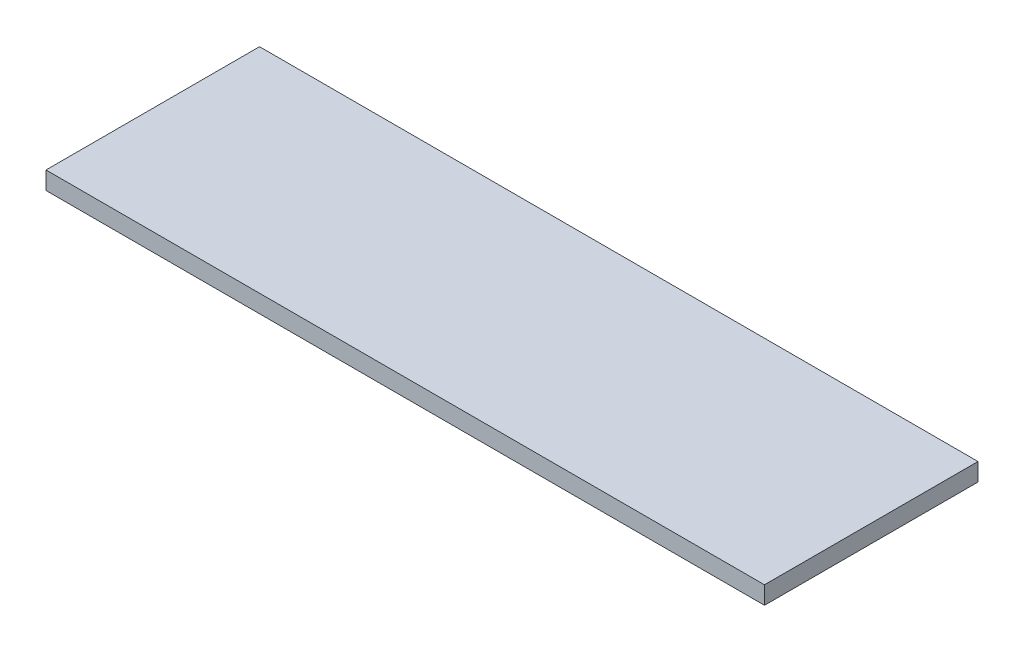
ISO-10303-21;
HEADER;
FILE_DESCRIPTION(('STEP AP214'),'2;1');
FILE_NAME('part.step','',(''),(''),'','','');
FILE_SCHEMA(('AUTOMOTIVE_DESIGN { 1 0 10303 214 1 1 1 1 }'));
ENDSEC;
DATA;
#1=APPLICATION_CONTEXT('core data for automotive mechanical design processes');
#2=APPLICATION_PROTOCOL_DEFINITION('international standard','automotive_design',2000,#1);
#3=PRODUCT_CONTEXT('',#1,'mechanical');
#4=PRODUCT('Part','Part','',(#3));
#5=PRODUCT_RELATED_PRODUCT_CATEGORY('part','',(#4));
#6=PRODUCT_DEFINITION_FORMATION('','',#4);
#7=PRODUCT_DEFINITION_CONTEXT('part definition',#1,'design');
#8=PRODUCT_DEFINITION('design','',#6,#7);
#9=PRODUCT_DEFINITION_SHAPE('','',#8);
#10=(LENGTH_UNIT() NAMED_UNIT(*) SI_UNIT(.MILLI.,.METRE.));
#11=(NAMED_UNIT(*) PLANE_ANGLE_UNIT() SI_UNIT($,.RADIAN.));
#12=(NAMED_UNIT(*) SI_UNIT($,.STERADIAN.) SOLID_ANGLE_UNIT());
#13=UNCERTAINTY_MEASURE_WITH_UNIT(LENGTH_MEASURE(1.E-05),#10,'distance_accuracy_value','');
#14=(GEOMETRIC_REPRESENTATION_CONTEXT(3) GLOBAL_UNCERTAINTY_ASSIGNED_CONTEXT((#13)) GLOBAL_UNIT_ASSIGNED_CONTEXT((#10,
#11,#12)) REPRESENTATION_CONTEXT('',''));
#15=CARTESIAN_POINT('',(0.,0.,0.));
#16=DIRECTION('',(0.,0.,1.));
#17=DIRECTION('',(1.,0.,0.));
#18=AXIS2_PLACEMENT_3D('',#15,#16,#17);
#19=CARTESIAN_POINT('',(64.099999943,3.175,-19.05));
#20=DIRECTION('',(-1.,0.,0.));
#21=DIRECTION('',(0.,0.,1.));
#22=AXIS2_PLACEMENT_3D('',#19,#20,#21);
#23=PLANE('',#22);
#24=DIRECTION('',(0.,0.,-1.));
#25=VECTOR('',#24,1.);
#26=CARTESIAN_POINT('',(64.099999943,0.,-19.05));
#27=LINE('',#26,#25);
#28=CARTESIAN_POINT('',(64.099999943,0.,19.05));
#29=VERTEX_POINT('',#28);
#30=CARTESIAN_POINT('',(64.099999943,0.,-19.05));
#31=VERTEX_POINT('',#30);
#32=EDGE_CURVE('E96',#29,#31,#27,.T.);
#33=ORIENTED_EDGE('',*,*,#32,.T.);
#34=DIRECTION('',(0.,-1.,0.));
#35=VECTOR('',#34,1.);
#36=CARTESIAN_POINT('',(64.099999943,3.175,-19.05));
#37=LINE('',#36,#35);
#38=CARTESIAN_POINT('',(64.099999943,3.175,-19.05));
#39=VERTEX_POINT('',#38);
#40=EDGE_CURVE('E11',#39,#31,#37,.T.);
#41=ORIENTED_EDGE('',*,*,#40,.F.);
#42=DIRECTION('',(0.,0.,-1.));
#43=VECTOR('',#42,1.);
#44=CARTESIAN_POINT('',(64.099999943,3.175,-19.05));
#45=LINE('',#44,#43);
#46=CARTESIAN_POINT('',(64.099999943,3.175,19.05));
#47=VERTEX_POINT('',#46);
#48=EDGE_CURVE('E84',#47,#39,#45,.T.);
#49=ORIENTED_EDGE('',*,*,#48,.F.);
#50=DIRECTION('',(0.,-1.,0.));
#51=VECTOR('',#50,1.);
#52=CARTESIAN_POINT('',(64.099999943,3.175,19.05));
#53=LINE('',#52,#51);
#54=EDGE_CURVE('E92',#47,#29,#53,.T.);
#55=ORIENTED_EDGE('',*,*,#54,.T.);
#56=EDGE_LOOP('',(#33,#41,#49,#55));
#57=FACE_BOUND('',#56,.T.);
#58=ADVANCED_FACE('F33',(#57),#23,.F.);
#59=CARTESIAN_POINT('',(-64.099999943,3.175,-19.05));
#60=DIRECTION('',(0.,0.,1.));
#61=DIRECTION('',(1.,0.,0.));
#62=AXIS2_PLACEMENT_3D('',#59,#60,#61);
#63=PLANE('',#62);
#64=DIRECTION('',(-1.,0.,0.));
#65=VECTOR('',#64,1.);
#66=CARTESIAN_POINT('',(-64.099999943,0.,-19.05));
#67=LINE('',#66,#65);
#68=CARTESIAN_POINT('',(-64.099999943,0.,-19.05));
#69=VERTEX_POINT('',#68);
#70=EDGE_CURVE('E88',#31,#69,#67,.T.);
#71=ORIENTED_EDGE('',*,*,#70,.T.);
#72=DIRECTION('',(0.,-1.,0.));
#73=VECTOR('',#72,1.);
#74=CARTESIAN_POINT('',(-64.099999943,3.175,-19.05));
#75=LINE('',#74,#73);
#76=CARTESIAN_POINT('',(-64.099999943,3.175,-19.05));
#77=VERTEX_POINT('',#76);
#78=EDGE_CURVE('E41',#77,#69,#75,.T.);
#79=ORIENTED_EDGE('',*,*,#78,.F.);
#80=DIRECTION('',(-1.,0.,0.));
#81=VECTOR('',#80,1.);
#82=CARTESIAN_POINT('',(-64.099999943,3.175,-19.05));
#83=LINE('',#82,#81);
#84=EDGE_CURVE('E79',#39,#77,#83,.T.);
#85=ORIENTED_EDGE('',*,*,#84,.F.);
#86=ORIENTED_EDGE('',*,*,#40,.T.);
#87=EDGE_LOOP('',(#71,#79,#85,#86));
#88=FACE_BOUND('',#87,.T.);
#89=ADVANCED_FACE('F87',(#88),#63,.F.);
#90=CARTESIAN_POINT('',(-64.099999943,3.175,-19.05));
#91=DIRECTION('',(1.,0.,0.));
#92=DIRECTION('',(0.,0.,-1.));
#93=AXIS2_PLACEMENT_3D('',#90,#91,#92);
#94=PLANE('',#93);
#95=DIRECTION('',(0.,0.,1.));
#96=VECTOR('',#95,1.);
#97=CARTESIAN_POINT('',(-64.099999943,0.,-19.05));
#98=LINE('',#97,#96);
#99=CARTESIAN_POINT('',(-64.099999943,0.,19.05));
#100=VERTEX_POINT('',#99);
#101=EDGE_CURVE('E66',#69,#100,#98,.T.);
#102=ORIENTED_EDGE('',*,*,#101,.T.);
#103=DIRECTION('',(0.,-1.,0.));
#104=VECTOR('',#103,1.);
#105=CARTESIAN_POINT('',(-64.099999943,3.175,19.05));
#106=LINE('',#105,#104);
#107=CARTESIAN_POINT('',(-64.099999943,3.175,19.05));
#108=VERTEX_POINT('',#107);
#109=EDGE_CURVE('E89',#108,#100,#106,.T.);
#110=ORIENTED_EDGE('',*,*,#109,.F.);
#111=DIRECTION('',(0.,0.,1.));
#112=VECTOR('',#111,1.);
#113=CARTESIAN_POINT('',(-64.099999943,3.175,-19.05));
#114=LINE('',#113,#112);
#115=EDGE_CURVE('E82',#77,#108,#114,.T.);
#116=ORIENTED_EDGE('',*,*,#115,.F.);
#117=ORIENTED_EDGE('',*,*,#78,.T.);
#118=EDGE_LOOP('',(#102,#110,#116,#117));
#119=FACE_BOUND('',#118,.T.);
#120=ADVANCED_FACE('F90',(#119),#94,.F.);
#121=CARTESIAN_POINT('',(-64.099999943,3.175,19.05));
#122=DIRECTION('',(0.,0.,-1.));
#123=DIRECTION('',(-1.,0.,0.));
#124=AXIS2_PLACEMENT_3D('',#121,#122,#123);
#125=PLANE('',#124);
#126=DIRECTION('',(1.,0.,0.));
#127=VECTOR('',#126,1.);
#128=CARTESIAN_POINT('',(-64.099999943,0.,19.05));
#129=LINE('',#128,#127);
#130=EDGE_CURVE('E72',#100,#29,#129,.T.);
#131=ORIENTED_EDGE('',*,*,#130,.T.);
#132=ORIENTED_EDGE('',*,*,#54,.F.);
#133=DIRECTION('',(1.,0.,0.));
#134=VECTOR('',#133,1.);
#135=CARTESIAN_POINT('',(-64.099999943,3.175,19.05));
#136=LINE('',#135,#134);
#137=EDGE_CURVE('E49',#108,#47,#136,.T.);
#138=ORIENTED_EDGE('',*,*,#137,.F.);
#139=ORIENTED_EDGE('',*,*,#109,.T.);
#140=EDGE_LOOP('',(#131,#132,#138,#139));
#141=FACE_BOUND('',#140,.T.);
#142=ADVANCED_FACE('F103',(#141),#125,.F.);
#143=CARTESIAN_POINT('',(0.,3.175,0.));
#144=DIRECTION('',(0.,1.,0.));
#145=DIRECTION('',(0.,0.,1.));
#146=AXIS2_PLACEMENT_3D('',#143,#144,#145);
#147=PLANE('',#146);
#148=ORIENTED_EDGE('',*,*,#48,.T.);
#149=ORIENTED_EDGE('',*,*,#84,.T.);
#150=ORIENTED_EDGE('',*,*,#115,.T.);
#151=ORIENTED_EDGE('',*,*,#137,.T.);
#152=EDGE_LOOP('',(#148,#149,#150,#151));
#153=FACE_BOUND('',#152,.T.);
#154=ADVANCED_FACE('F80',(#153),#147,.T.);
#155=CARTESIAN_POINT('',(0.,0.,0.));
#156=DIRECTION('',(0.,1.,0.));
#157=DIRECTION('',(0.,0.,1.));
#158=AXIS2_PLACEMENT_3D('',#155,#156,#157);
#159=PLANE('',#158);
#160=ORIENTED_EDGE('',*,*,#32,.F.);
#161=ORIENTED_EDGE('',*,*,#130,.F.);
#162=ORIENTED_EDGE('',*,*,#101,.F.);
#163=ORIENTED_EDGE('',*,*,#70,.F.);
#164=EDGE_LOOP('',(#160,#161,#162,#163));
#165=FACE_BOUND('',#164,.T.);
#166=ADVANCED_FACE('F106',(#165),#159,.F.);
#167=CLOSED_SHELL('',(#58,#89,#120,#142,#154,#166));
#168=MANIFOLD_SOLID_BREP('B2',#167);
#169=ADVANCED_BREP_SHAPE_REPRESENTATION('',(#18,#168),#14);
#170=SHAPE_DEFINITION_REPRESENTATION(#9,#169);
ENDSEC;
END-ISO-10303-21;
